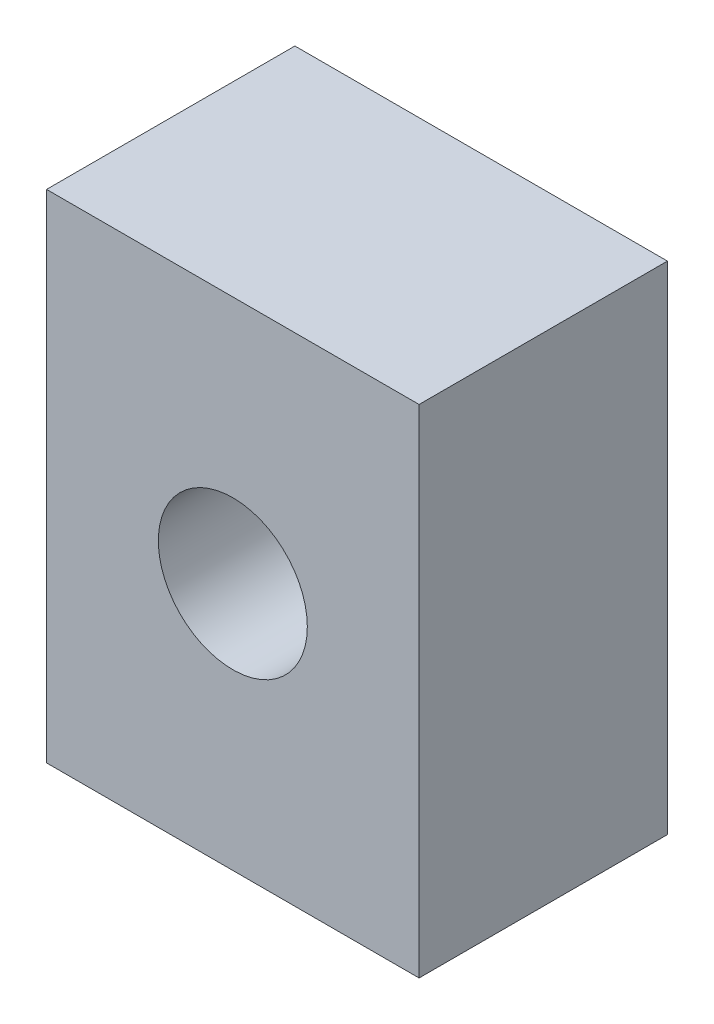
ISO-10303-21;
HEADER;
FILE_DESCRIPTION(('STEP AP214'),'2;1');
FILE_NAME('part.step','',(''),(''),'','','');
FILE_SCHEMA(('AUTOMOTIVE_DESIGN { 1 0 10303 214 1 1 1 1 }'));
ENDSEC;
DATA;
#1=APPLICATION_CONTEXT('core data for automotive mechanical design processes');
#2=APPLICATION_PROTOCOL_DEFINITION('international standard','automotive_design',2000,#1);
#3=PRODUCT_CONTEXT('',#1,'mechanical');
#4=PRODUCT('Part','Part','',(#3));
#5=PRODUCT_RELATED_PRODUCT_CATEGORY('part','',(#4));
#6=PRODUCT_DEFINITION_FORMATION('','',#4);
#7=PRODUCT_DEFINITION_CONTEXT('part definition',#1,'design');
#8=PRODUCT_DEFINITION('design','',#6,#7);
#9=PRODUCT_DEFINITION_SHAPE('','',#8);
#10=(LENGTH_UNIT() NAMED_UNIT(*) SI_UNIT(.MILLI.,.METRE.));
#11=(NAMED_UNIT(*) PLANE_ANGLE_UNIT() SI_UNIT($,.RADIAN.));
#12=(NAMED_UNIT(*) SI_UNIT($,.STERADIAN.) SOLID_ANGLE_UNIT());
#13=UNCERTAINTY_MEASURE_WITH_UNIT(LENGTH_MEASURE(1.E-05),#10,'distance_accuracy_value','');
#14=(GEOMETRIC_REPRESENTATION_CONTEXT(3) GLOBAL_UNCERTAINTY_ASSIGNED_CONTEXT((#13)) GLOBAL_UNIT_ASSIGNED_CONTEXT((#10,
#11,#12)) REPRESENTATION_CONTEXT('',''));
#15=CARTESIAN_POINT('',(0.,0.,0.));
#16=DIRECTION('',(0.,0.,1.));
#17=DIRECTION('',(1.,0.,0.));
#18=AXIS2_PLACEMENT_3D('',#15,#16,#17);
#19=CARTESIAN_POINT('',(0.,0.,20.));
#20=DIRECTION('',(1.,0.,0.));
#21=DIRECTION('',(0.,0.,-1.));
#22=AXIS2_PLACEMENT_3D('',#19,#20,#21);
#23=PLANE('',#22);
#24=DIRECTION('',(0.,-1.,0.));
#25=VECTOR('',#24,1.);
#26=CARTESIAN_POINT('',(0.,0.,0.));
#27=LINE('',#26,#25);
#28=CARTESIAN_POINT('',(0.,40.,0.));
#29=VERTEX_POINT('',#28);
#30=CARTESIAN_POINT('',(0.,0.,0.));
#31=VERTEX_POINT('',#30);
#32=EDGE_CURVE('E98',#29,#31,#27,.T.);
#33=ORIENTED_EDGE('',*,*,#32,.T.);
#34=DIRECTION('',(0.,0.,-1.));
#35=VECTOR('',#34,1.);
#36=CARTESIAN_POINT('',(0.,0.,20.));
#37=LINE('',#36,#35);
#38=CARTESIAN_POINT('',(0.,0.,20.));
#39=VERTEX_POINT('',#38);
#40=EDGE_CURVE('E11',#39,#31,#37,.T.);
#41=ORIENTED_EDGE('',*,*,#40,.F.);
#42=DIRECTION('',(0.,-1.,0.));
#43=VECTOR('',#42,1.);
#44=CARTESIAN_POINT('',(0.,0.,20.));
#45=LINE('',#44,#43);
#46=CARTESIAN_POINT('',(0.,40.,20.));
#47=VERTEX_POINT('',#46);
#48=EDGE_CURVE('E86',#47,#39,#45,.T.);
#49=ORIENTED_EDGE('',*,*,#48,.F.);
#50=DIRECTION('',(0.,0.,-1.));
#51=VECTOR('',#50,1.);
#52=CARTESIAN_POINT('',(0.,40.,20.));
#53=LINE('',#52,#51);
#54=EDGE_CURVE('E94',#47,#29,#53,.T.);
#55=ORIENTED_EDGE('',*,*,#54,.T.);
#56=EDGE_LOOP('',(#33,#41,#49,#55));
#57=FACE_BOUND('',#56,.T.);
#58=ADVANCED_FACE('F35',(#57),#23,.F.);
#59=CARTESIAN_POINT('',(0.,0.,20.));
#60=DIRECTION('',(0.,1.,0.));
#61=DIRECTION('',(0.,0.,1.));
#62=AXIS2_PLACEMENT_3D('',#59,#60,#61);
#63=PLANE('',#62);
#64=DIRECTION('',(1.,0.,0.));
#65=VECTOR('',#64,1.);
#66=CARTESIAN_POINT('',(0.,0.,0.));
#67=LINE('',#66,#65);
#68=CARTESIAN_POINT('',(30.,0.,0.));
#69=VERTEX_POINT('',#68);
#70=EDGE_CURVE('E90',#31,#69,#67,.T.);
#71=ORIENTED_EDGE('',*,*,#70,.T.);
#72=DIRECTION('',(0.,0.,-1.));
#73=VECTOR('',#72,1.);
#74=CARTESIAN_POINT('',(30.,0.,20.));
#75=LINE('',#74,#73);
#76=CARTESIAN_POINT('',(30.,0.,20.));
#77=VERTEX_POINT('',#76);
#78=EDGE_CURVE('E43',#77,#69,#75,.T.);
#79=ORIENTED_EDGE('',*,*,#78,.F.);
#80=DIRECTION('',(1.,0.,0.));
#81=VECTOR('',#80,1.);
#82=CARTESIAN_POINT('',(0.,0.,20.));
#83=LINE('',#82,#81);
#84=EDGE_CURVE('E81',#39,#77,#83,.T.);
#85=ORIENTED_EDGE('',*,*,#84,.F.);
#86=ORIENTED_EDGE('',*,*,#40,.T.);
#87=EDGE_LOOP('',(#71,#79,#85,#86));
#88=FACE_BOUND('',#87,.T.);
#89=ADVANCED_FACE('F89',(#88),#63,.F.);
#90=CARTESIAN_POINT('',(30.,0.,20.));
#91=DIRECTION('',(-1.,0.,0.));
#92=DIRECTION('',(0.,0.,1.));
#93=AXIS2_PLACEMENT_3D('',#90,#91,#92);
#94=PLANE('',#93);
#95=DIRECTION('',(0.,1.,0.));
#96=VECTOR('',#95,1.);
#97=CARTESIAN_POINT('',(30.,0.,0.));
#98=LINE('',#97,#96);
#99=CARTESIAN_POINT('',(30.,40.,0.));
#100=VERTEX_POINT('',#99);
#101=EDGE_CURVE('E68',#69,#100,#98,.T.);
#102=ORIENTED_EDGE('',*,*,#101,.T.);
#103=DIRECTION('',(0.,0.,-1.));
#104=VECTOR('',#103,1.);
#105=CARTESIAN_POINT('',(30.,40.,20.));
#106=LINE('',#105,#104);
#107=CARTESIAN_POINT('',(30.,40.,20.));
#108=VERTEX_POINT('',#107);
#109=EDGE_CURVE('E91',#108,#100,#106,.T.);
#110=ORIENTED_EDGE('',*,*,#109,.F.);
#111=DIRECTION('',(0.,1.,0.));
#112=VECTOR('',#111,1.);
#113=CARTESIAN_POINT('',(30.,0.,20.));
#114=LINE('',#113,#112);
#115=EDGE_CURVE('E84',#77,#108,#114,.T.);
#116=ORIENTED_EDGE('',*,*,#115,.F.);
#117=ORIENTED_EDGE('',*,*,#78,.T.);
#118=EDGE_LOOP('',(#102,#110,#116,#117));
#119=FACE_BOUND('',#118,.T.);
#120=ADVANCED_FACE('F92',(#119),#94,.F.);
#121=CARTESIAN_POINT('',(0.,40.,20.));
#122=DIRECTION('',(0.,-1.,0.));
#123=DIRECTION('',(0.,0.,-1.));
#124=AXIS2_PLACEMENT_3D('',#121,#122,#123);
#125=PLANE('',#124);
#126=DIRECTION('',(-1.,0.,0.));
#127=VECTOR('',#126,1.);
#128=CARTESIAN_POINT('',(0.,40.,0.));
#129=LINE('',#128,#127);
#130=EDGE_CURVE('E74',#100,#29,#129,.T.);
#131=ORIENTED_EDGE('',*,*,#130,.T.);
#132=ORIENTED_EDGE('',*,*,#54,.F.);
#133=DIRECTION('',(-1.,0.,0.));
#134=VECTOR('',#133,1.);
#135=CARTESIAN_POINT('',(0.,40.,20.));
#136=LINE('',#135,#134);
#137=EDGE_CURVE('E51',#108,#47,#136,.T.);
#138=ORIENTED_EDGE('',*,*,#137,.F.);
#139=ORIENTED_EDGE('',*,*,#109,.T.);
#140=EDGE_LOOP('',(#131,#132,#138,#139));
#141=FACE_BOUND('',#140,.T.);
#142=ADVANCED_FACE('F106',(#141),#125,.F.);
#143=CARTESIAN_POINT('',(0.,0.,20.));
#144=DIRECTION('',(0.,0.,-1.));
#145=DIRECTION('',(-1.,0.,0.));
#146=AXIS2_PLACEMENT_3D('',#143,#144,#145);
#147=PLANE('',#146);
#148=CARTESIAN_POINT('',(15.,20.,20.));
#149=DIRECTION('',(0.,0.,1.));
#150=DIRECTION('',(1.,0.,0.));
#151=AXIS2_PLACEMENT_3D('',#148,#149,#150);
#152=CIRCLE('',#151,6.);
#153=CARTESIAN_POINT('',(21.,20.,20.));
#154=VERTEX_POINT('',#153);
#155=EDGE_CURVE('E112',#154,#154,#152,.T.);
#156=ORIENTED_EDGE('',*,*,#155,.F.);
#157=EDGE_LOOP('',(#156));
#158=FACE_BOUND('',#157,.T.);
#159=ORIENTED_EDGE('',*,*,#48,.T.);
#160=ORIENTED_EDGE('',*,*,#84,.T.);
#161=ORIENTED_EDGE('',*,*,#115,.T.);
#162=ORIENTED_EDGE('',*,*,#137,.T.);
#163=EDGE_LOOP('',(#159,#160,#161,#162));
#164=FACE_BOUND('',#163,.T.);
#165=ADVANCED_FACE('F82',(#158,#164),#147,.F.);
#166=CARTESIAN_POINT('',(0.,0.,0.));
#167=DIRECTION('',(0.,0.,-1.));
#168=DIRECTION('',(-1.,0.,0.));
#169=AXIS2_PLACEMENT_3D('',#166,#167,#168);
#170=PLANE('',#169);
#171=ORIENTED_EDGE('',*,*,#32,.F.);
#172=ORIENTED_EDGE('',*,*,#130,.F.);
#173=ORIENTED_EDGE('',*,*,#101,.F.);
#174=ORIENTED_EDGE('',*,*,#70,.F.);
#175=EDGE_LOOP('',(#171,#172,#173,#174));
#176=FACE_BOUND('',#175,.T.);
#177=ADVANCED_FACE('F109',(#176),#170,.T.);
#178=CARTESIAN_POINT('',(15.,20.,8.));
#179=DIRECTION('',(0.,0.,1.));
#180=DIRECTION('',(1.,0.,0.));
#181=AXIS2_PLACEMENT_3D('',#178,#179,#180);
#182=CYLINDRICAL_SURFACE('',#181,6.);
#183=CARTESIAN_POINT('',(15.,20.,8.));
#184=DIRECTION('',(0.,0.,1.));
#185=DIRECTION('',(1.,0.,0.));
#186=AXIS2_PLACEMENT_3D('',#183,#184,#185);
#187=CIRCLE('',#186,6.);
#188=CARTESIAN_POINT('',(21.,20.,8.));
#189=VERTEX_POINT('',#188);
#190=EDGE_CURVE('E101',#189,#189,#187,.T.);
#191=ORIENTED_EDGE('',*,*,#190,.F.);
#192=EDGE_LOOP('',(#191));
#193=FACE_BOUND('',#192,.T.);
#194=ORIENTED_EDGE('',*,*,#155,.T.);
#195=EDGE_LOOP('',(#194));
#196=FACE_BOUND('',#195,.T.);
#197=ADVANCED_FACE('F120',(#193,#196),#182,.F.);
#198=CARTESIAN_POINT('',(15.,20.,8.));
#199=DIRECTION('',(0.,0.,1.));
#200=DIRECTION('',(1.,0.,0.));
#201=AXIS2_PLACEMENT_3D('',#198,#199,#200);
#202=PLANE('',#201);
#203=ORIENTED_EDGE('',*,*,#190,.T.);
#204=EDGE_LOOP('',(#203));
#205=FACE_BOUND('',#204,.T.);
#206=ADVANCED_FACE('F118',(#205),#202,.T.);
#207=CLOSED_SHELL('',(#58,#89,#120,#142,#165,#177,#197,#206));
#208=MANIFOLD_SOLID_BREP('B2',#207);
#209=ADVANCED_BREP_SHAPE_REPRESENTATION('',(#18,#208),#14);
#210=SHAPE_DEFINITION_REPRESENTATION(#9,#209);
ENDSEC;
END-ISO-10303-21;
